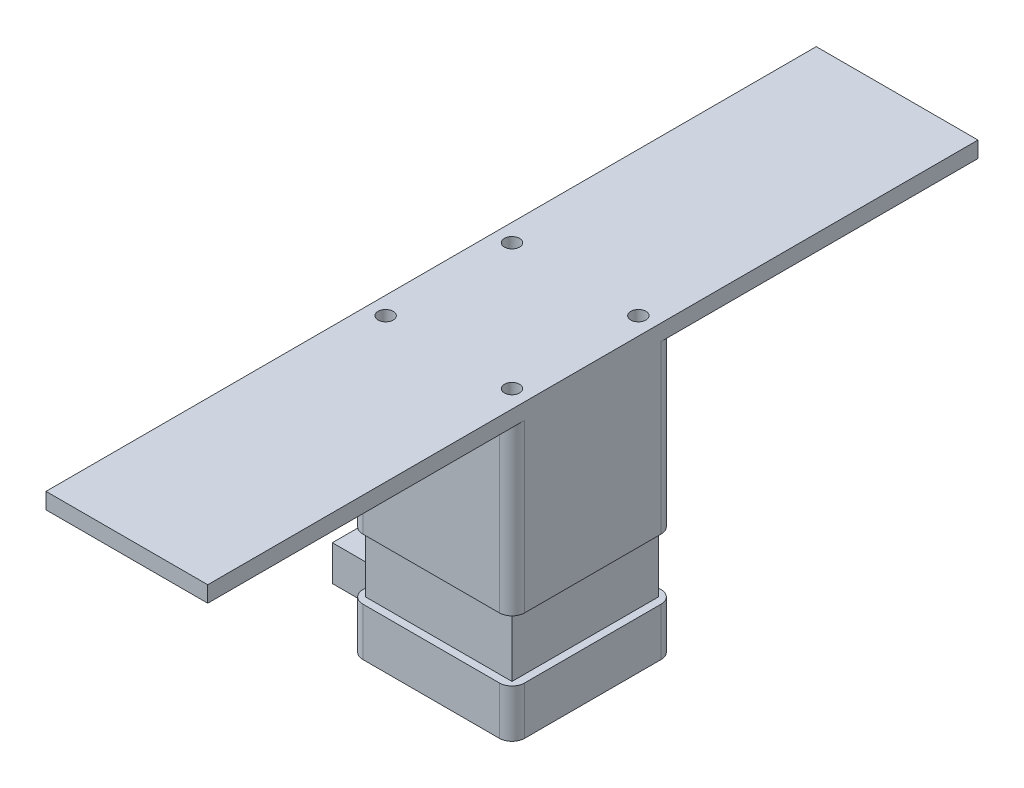
ISO-10303-21;
HEADER;
FILE_DESCRIPTION(('STEP AP214'),'2;1');
FILE_NAME('part.step','',(''),(''),'','','');
FILE_SCHEMA(('AUTOMOTIVE_DESIGN { 1 0 10303 214 1 1 1 1 }'));
ENDSEC;
DATA;
#1=APPLICATION_CONTEXT('core data for automotive mechanical design processes');
#2=APPLICATION_PROTOCOL_DEFINITION('international standard','automotive_design',2000,#1);
#3=PRODUCT_CONTEXT('',#1,'mechanical');
#4=PRODUCT('Part','Part','',(#3));
#5=PRODUCT_RELATED_PRODUCT_CATEGORY('part','',(#4));
#6=PRODUCT_DEFINITION_FORMATION('','',#4);
#7=PRODUCT_DEFINITION_CONTEXT('part definition',#1,'design');
#8=PRODUCT_DEFINITION('design','',#6,#7);
#9=PRODUCT_DEFINITION_SHAPE('','',#8);
#10=(LENGTH_UNIT() NAMED_UNIT(*) SI_UNIT(.MILLI.,.METRE.));
#11=(NAMED_UNIT(*) PLANE_ANGLE_UNIT() SI_UNIT($,.RADIAN.));
#12=(NAMED_UNIT(*) SI_UNIT($,.STERADIAN.) SOLID_ANGLE_UNIT());
#13=UNCERTAINTY_MEASURE_WITH_UNIT(LENGTH_MEASURE(1.E-05),#10,'distance_accuracy_value','');
#14=(GEOMETRIC_REPRESENTATION_CONTEXT(3) GLOBAL_UNCERTAINTY_ASSIGNED_CONTEXT((#13)) GLOBAL_UNIT_ASSIGNED_CONTEXT((#10,
#11,#12)) REPRESENTATION_CONTEXT('',''));
#15=CARTESIAN_POINT('',(0.,0.,0.));
#16=DIRECTION('',(0.,0.,1.));
#17=DIRECTION('',(1.,0.,0.));
#18=AXIS2_PLACEMENT_3D('',#15,#16,#17);
#19=CARTESIAN_POINT('',(0.,19.,5.00000000000004));
#20=DIRECTION('',(1.,0.,0.));
#21=DIRECTION('',(0.,0.,-1.));
#22=AXIS2_PLACEMENT_3D('',#19,#20,#21);
#23=PLANE('',#22);
#24=DIRECTION('',(0.,0.,1.));
#25=VECTOR('',#24,1.);
#26=CARTESIAN_POINT('',(0.,0.,5.00000000000004));
#27=LINE('',#26,#25);
#28=CARTESIAN_POINT('',(0.,0.,5.00000000000004));
#29=VERTEX_POINT('',#28);
#30=CARTESIAN_POINT('',(0.,0.,59.));
#31=VERTEX_POINT('',#30);
#32=EDGE_CURVE('E386',#29,#31,#27,.T.);
#33=ORIENTED_EDGE('',*,*,#32,.T.);
#34=DIRECTION('',(0.,-1.,0.));
#35=VECTOR('',#34,1.);
#36=CARTESIAN_POINT('',(0.,19.,59.));
#37=LINE('',#36,#35);
#38=CARTESIAN_POINT('',(0.,19.,59.));
#39=VERTEX_POINT('',#38);
#40=EDGE_CURVE('E41',#39,#31,#37,.T.);
#41=ORIENTED_EDGE('',*,*,#40,.F.);
#42=DIRECTION('',(0.,0.,1.));
#43=VECTOR('',#42,1.);
#44=CARTESIAN_POINT('',(0.,19.,5.00000000000004));
#45=LINE('',#44,#43);
#46=CARTESIAN_POINT('',(0.,19.,5.00000000000004));
#47=VERTEX_POINT('',#46);
#48=EDGE_CURVE('E368',#47,#39,#45,.T.);
#49=ORIENTED_EDGE('',*,*,#48,.F.);
#50=DIRECTION('',(0.,-1.,0.));
#51=VECTOR('',#50,1.);
#52=CARTESIAN_POINT('',(0.,19.,5.00000000000004));
#53=LINE('',#52,#51);
#54=EDGE_CURVE('E11',#47,#29,#53,.T.);
#55=ORIENTED_EDGE('',*,*,#54,.T.);
#56=EDGE_LOOP('',(#33,#41,#49,#55));
#57=FACE_BOUND('',#56,.T.);
#58=DIRECTION('',(0.,-1.,0.));
#59=VECTOR('',#58,1.);
#60=CARTESIAN_POINT('',(0.,16.,18.));
#61=LINE('',#60,#59);
#62=CARTESIAN_POINT('',(0.,16.,18.));
#63=VERTEX_POINT('',#62);
#64=CARTESIAN_POINT('',(0.,2.,18.));
#65=VERTEX_POINT('',#64);
#66=EDGE_CURVE('E241',#63,#65,#61,.T.);
#67=ORIENTED_EDGE('',*,*,#66,.F.);
#68=DIRECTION('',(0.,0.,-1.));
#69=VECTOR('',#68,1.);
#70=CARTESIAN_POINT('',(0.,16.,18.));
#71=LINE('',#70,#69);
#72=CARTESIAN_POINT('',(0.,16.,46.));
#73=VERTEX_POINT('',#72);
#74=EDGE_CURVE('E253',#73,#63,#71,.T.);
#75=ORIENTED_EDGE('',*,*,#74,.F.);
#76=DIRECTION('',(0.,1.,0.));
#77=VECTOR('',#76,1.);
#78=CARTESIAN_POINT('',(0.,16.,46.));
#79=LINE('',#78,#77);
#80=CARTESIAN_POINT('',(0.,2.,46.));
#81=VERTEX_POINT('',#80);
#82=EDGE_CURVE('E53',#81,#73,#79,.T.);
#83=ORIENTED_EDGE('',*,*,#82,.F.);
#84=DIRECTION('',(0.,0.,1.));
#85=VECTOR('',#84,1.);
#86=CARTESIAN_POINT('',(0.,2.,18.));
#87=LINE('',#86,#85);
#88=EDGE_CURVE('E48',#65,#81,#87,.T.);
#89=ORIENTED_EDGE('',*,*,#88,.F.);
#90=EDGE_LOOP('',(#67,#75,#83,#89));
#91=FACE_BOUND('',#90,.T.);
#92=ADVANCED_FACE('F33',(#57,#91),#23,.F.);
#93=CARTESIAN_POINT('',(5.,19.,5.));
#94=DIRECTION('',(0.,-1.,0.));
#95=DIRECTION('',(0.,0.,-1.));
#96=AXIS2_PLACEMENT_3D('',#93,#94,#95);
#97=CYLINDRICAL_SURFACE('',#96,5.);
#98=CARTESIAN_POINT('',(5.,0.,5.));
#99=DIRECTION('',(0.,1.,0.));
#100=DIRECTION('',(0.,0.,1.));
#101=AXIS2_PLACEMENT_3D('',#98,#99,#100);
#102=CIRCLE('',#101,5.);
#103=CARTESIAN_POINT('',(5.00000000000004,0.,0.));
#104=VERTEX_POINT('',#103);
#105=EDGE_CURVE('E364',#104,#29,#102,.T.);
#106=ORIENTED_EDGE('',*,*,#105,.T.);
#107=ORIENTED_EDGE('',*,*,#54,.F.);
#108=CARTESIAN_POINT('',(5.,19.,5.));
#109=DIRECTION('',(0.,1.,0.));
#110=DIRECTION('',(0.,0.,1.));
#111=AXIS2_PLACEMENT_3D('',#108,#109,#110);
#112=CIRCLE('',#111,5.);
#113=CARTESIAN_POINT('',(5.00000000000004,19.,0.));
#114=VERTEX_POINT('',#113);
#115=EDGE_CURVE('E365',#114,#47,#112,.T.);
#116=ORIENTED_EDGE('',*,*,#115,.F.);
#117=DIRECTION('',(0.,-1.,0.));
#118=VECTOR('',#117,1.);
#119=CARTESIAN_POINT('',(5.00000000000004,19.,0.));
#120=LINE('',#119,#118);
#121=EDGE_CURVE('E383',#114,#104,#120,.T.);
#122=ORIENTED_EDGE('',*,*,#121,.T.);
#123=EDGE_LOOP('',(#106,#107,#116,#122));
#124=FACE_BOUND('',#123,.T.);
#125=ADVANCED_FACE('F35',(#124),#97,.T.);
#126=CARTESIAN_POINT('',(5.00000000000001,19.,59.));
#127=DIRECTION('',(0.,-1.,0.));
#128=DIRECTION('',(0.,0.,-1.));
#129=AXIS2_PLACEMENT_3D('',#126,#127,#128);
#130=CYLINDRICAL_SURFACE('',#129,5.);
#131=CARTESIAN_POINT('',(5.00000000000001,0.,59.));
#132=DIRECTION('',(0.,1.,0.));
#133=DIRECTION('',(0.,0.,1.));
#134=AXIS2_PLACEMENT_3D('',#131,#132,#133);
#135=CIRCLE('',#134,5.);
#136=CARTESIAN_POINT('',(5.00000000000005,0.,64.));
#137=VERTEX_POINT('',#136);
#138=EDGE_CURVE('E388',#31,#137,#135,.T.);
#139=ORIENTED_EDGE('',*,*,#138,.T.);
#140=DIRECTION('',(0.,-1.,0.));
#141=VECTOR('',#140,1.);
#142=CARTESIAN_POINT('',(5.00000000000005,19.,64.));
#143=LINE('',#142,#141);
#144=CARTESIAN_POINT('',(5.00000000000005,19.,64.));
#145=VERTEX_POINT('',#144);
#146=EDGE_CURVE('E413',#145,#137,#143,.T.);
#147=ORIENTED_EDGE('',*,*,#146,.F.);
#148=CARTESIAN_POINT('',(5.00000000000001,19.,59.));
#149=DIRECTION('',(0.,1.,0.));
#150=DIRECTION('',(0.,0.,1.));
#151=AXIS2_PLACEMENT_3D('',#148,#149,#150);
#152=CIRCLE('',#151,5.);
#153=EDGE_CURVE('E371',#39,#145,#152,.T.);
#154=ORIENTED_EDGE('',*,*,#153,.F.);
#155=ORIENTED_EDGE('',*,*,#40,.T.);
#156=EDGE_LOOP('',(#139,#147,#154,#155));
#157=FACE_BOUND('',#156,.T.);
#158=ADVANCED_FACE('F420',(#157),#130,.T.);
#159=CARTESIAN_POINT('',(5.00000000000005,19.,64.));
#160=DIRECTION('',(0.,0.,-1.));
#161=DIRECTION('',(-1.,0.,0.));
#162=AXIS2_PLACEMENT_3D('',#159,#160,#161);
#163=PLANE('',#162);
#164=DIRECTION('',(1.,0.,0.));
#165=VECTOR('',#164,1.);
#166=CARTESIAN_POINT('',(5.00000000000005,0.,64.));
#167=LINE('',#166,#165);
#168=CARTESIAN_POINT('',(59.,0.,64.));
#169=VERTEX_POINT('',#168);
#170=EDGE_CURVE('E390',#137,#169,#167,.T.);
#171=ORIENTED_EDGE('',*,*,#170,.T.);
#172=DIRECTION('',(0.,-1.,0.));
#173=VECTOR('',#172,1.);
#174=CARTESIAN_POINT('',(59.,19.,64.));
#175=LINE('',#174,#173);
#176=CARTESIAN_POINT('',(59.,19.,64.));
#177=VERTEX_POINT('',#176);
#178=EDGE_CURVE('E410',#177,#169,#175,.T.);
#179=ORIENTED_EDGE('',*,*,#178,.F.);
#180=DIRECTION('',(1.,0.,0.));
#181=VECTOR('',#180,1.);
#182=CARTESIAN_POINT('',(5.00000000000005,19.,64.));
#183=LINE('',#182,#181);
#184=EDGE_CURVE('E373',#145,#177,#183,.T.);
#185=ORIENTED_EDGE('',*,*,#184,.F.);
#186=ORIENTED_EDGE('',*,*,#146,.T.);
#187=EDGE_LOOP('',(#171,#179,#185,#186));
#188=FACE_BOUND('',#187,.T.);
#189=ADVANCED_FACE('F431',(#188),#163,.F.);
#190=CARTESIAN_POINT('',(59.,19.,59.));
#191=DIRECTION('',(0.,-1.,0.));
#192=DIRECTION('',(0.,0.,-1.));
#193=AXIS2_PLACEMENT_3D('',#190,#191,#192);
#194=CYLINDRICAL_SURFACE('',#193,5.);
#195=CARTESIAN_POINT('',(59.,0.,59.));
#196=DIRECTION('',(0.,1.,0.));
#197=DIRECTION('',(0.,0.,-1.));
#198=AXIS2_PLACEMENT_3D('',#195,#196,#197);
#199=CIRCLE('',#198,5.);
#200=CARTESIAN_POINT('',(64.,0.,59.));
#201=VERTEX_POINT('',#200);
#202=EDGE_CURVE('E392',#169,#201,#199,.T.);
#203=ORIENTED_EDGE('',*,*,#202,.T.);
#204=DIRECTION('',(0.,-1.,0.));
#205=VECTOR('',#204,1.);
#206=CARTESIAN_POINT('',(64.,19.,59.));
#207=LINE('',#206,#205);
#208=CARTESIAN_POINT('',(64.,19.,59.));
#209=VERTEX_POINT('',#208);
#210=EDGE_CURVE('E407',#209,#201,#207,.T.);
#211=ORIENTED_EDGE('',*,*,#210,.F.);
#212=CARTESIAN_POINT('',(59.,19.,59.));
#213=DIRECTION('',(0.,1.,0.));
#214=DIRECTION('',(0.,0.,-1.));
#215=AXIS2_PLACEMENT_3D('',#212,#213,#214);
#216=CIRCLE('',#215,5.);
#217=EDGE_CURVE('E375',#177,#209,#216,.T.);
#218=ORIENTED_EDGE('',*,*,#217,.F.);
#219=ORIENTED_EDGE('',*,*,#178,.T.);
#220=EDGE_LOOP('',(#203,#211,#218,#219));
#221=FACE_BOUND('',#220,.T.);
#222=ADVANCED_FACE('F435',(#221),#194,.T.);
#223=CARTESIAN_POINT('',(64.,19.,5.00000000000003));
#224=DIRECTION('',(-1.,0.,0.));
#225=DIRECTION('',(0.,0.,1.));
#226=AXIS2_PLACEMENT_3D('',#223,#224,#225);
#227=PLANE('',#226);
#228=DIRECTION('',(0.,0.,-1.));
#229=VECTOR('',#228,1.);
#230=CARTESIAN_POINT('',(64.,0.,5.00000000000003));
#231=LINE('',#230,#229);
#232=CARTESIAN_POINT('',(64.,0.,5.00000000000004));
#233=VERTEX_POINT('',#232);
#234=EDGE_CURVE('E394',#201,#233,#231,.T.);
#235=ORIENTED_EDGE('',*,*,#234,.T.);
#236=DIRECTION('',(0.,-1.,0.));
#237=VECTOR('',#236,1.);
#238=CARTESIAN_POINT('',(64.,19.,5.00000000000004));
#239=LINE('',#238,#237);
#240=CARTESIAN_POINT('',(64.,19.,5.00000000000004));
#241=VERTEX_POINT('',#240);
#242=EDGE_CURVE('E404',#241,#233,#239,.T.);
#243=ORIENTED_EDGE('',*,*,#242,.F.);
#244=DIRECTION('',(0.,0.,-1.));
#245=VECTOR('',#244,1.);
#246=CARTESIAN_POINT('',(64.,19.,5.00000000000003));
#247=LINE('',#246,#245);
#248=EDGE_CURVE('E377',#209,#241,#247,.T.);
#249=ORIENTED_EDGE('',*,*,#248,.F.);
#250=ORIENTED_EDGE('',*,*,#210,.T.);
#251=EDGE_LOOP('',(#235,#243,#249,#250));
#252=FACE_BOUND('',#251,.T.);
#253=ADVANCED_FACE('F455',(#252),#227,.F.);
#254=CARTESIAN_POINT('',(59.,19.,5.));
#255=DIRECTION('',(0.,-1.,0.));
#256=DIRECTION('',(0.,0.,-1.));
#257=AXIS2_PLACEMENT_3D('',#254,#255,#256);
#258=CYLINDRICAL_SURFACE('',#257,5.);
#259=CARTESIAN_POINT('',(59.,0.,5.));
#260=DIRECTION('',(0.,1.,0.));
#261=DIRECTION('',(0.,0.,-1.));
#262=AXIS2_PLACEMENT_3D('',#259,#260,#261);
#263=CIRCLE('',#262,5.);
#264=CARTESIAN_POINT('',(59.,0.,0.));
#265=VERTEX_POINT('',#264);
#266=EDGE_CURVE('E396',#233,#265,#263,.T.);
#267=ORIENTED_EDGE('',*,*,#266,.T.);
#268=DIRECTION('',(0.,-1.,0.));
#269=VECTOR('',#268,1.);
#270=CARTESIAN_POINT('',(59.,19.,0.));
#271=LINE('',#270,#269);
#272=CARTESIAN_POINT('',(59.,19.,0.));
#273=VERTEX_POINT('',#272);
#274=EDGE_CURVE('E401',#273,#265,#271,.T.);
#275=ORIENTED_EDGE('',*,*,#274,.F.);
#276=CARTESIAN_POINT('',(59.,19.,5.));
#277=DIRECTION('',(0.,1.,0.));
#278=DIRECTION('',(0.,0.,-1.));
#279=AXIS2_PLACEMENT_3D('',#276,#277,#278);
#280=CIRCLE('',#279,5.);
#281=EDGE_CURVE('E379',#241,#273,#280,.T.);
#282=ORIENTED_EDGE('',*,*,#281,.F.);
#283=ORIENTED_EDGE('',*,*,#242,.T.);
#284=EDGE_LOOP('',(#267,#275,#282,#283));
#285=FACE_BOUND('',#284,.T.);
#286=ADVANCED_FACE('F453',(#285),#258,.T.);
#287=CARTESIAN_POINT('',(5.00000000000004,19.,0.));
#288=DIRECTION('',(0.,0.,1.));
#289=DIRECTION('',(1.,0.,0.));
#290=AXIS2_PLACEMENT_3D('',#287,#288,#289);
#291=PLANE('',#290);
#292=DIRECTION('',(-1.,0.,0.));
#293=VECTOR('',#292,1.);
#294=CARTESIAN_POINT('',(5.00000000000004,0.,0.));
#295=LINE('',#294,#293);
#296=EDGE_CURVE('E369',#265,#104,#295,.T.);
#297=ORIENTED_EDGE('',*,*,#296,.T.);
#298=ORIENTED_EDGE('',*,*,#121,.F.);
#299=DIRECTION('',(-1.,0.,0.));
#300=VECTOR('',#299,1.);
#301=CARTESIAN_POINT('',(5.00000000000004,19.,0.));
#302=LINE('',#301,#300);
#303=EDGE_CURVE('E381',#273,#114,#302,.T.);
#304=ORIENTED_EDGE('',*,*,#303,.F.);
#305=ORIENTED_EDGE('',*,*,#274,.T.);
#306=EDGE_LOOP('',(#297,#298,#304,#305));
#307=FACE_BOUND('',#306,.T.);
#308=ADVANCED_FACE('F448',(#307),#291,.F.);
#309=CARTESIAN_POINT('',(5.,19.,5.));
#310=DIRECTION('',(0.,1.,0.));
#311=DIRECTION('',(0.,0.,1.));
#312=AXIS2_PLACEMENT_3D('',#309,#310,#311);
#313=PLANE('',#312);
#314=DIRECTION('',(0.,0.,1.));
#315=VECTOR('',#314,1.);
#316=CARTESIAN_POINT('',(3.,19.,3.));
#317=LINE('',#316,#315);
#318=CARTESIAN_POINT('',(3.,19.,3.));
#319=VERTEX_POINT('',#318);
#320=CARTESIAN_POINT('',(3.00000000000001,19.,61.));
#321=VERTEX_POINT('',#320);
#322=EDGE_CURVE('E328',#319,#321,#317,.T.);
#323=ORIENTED_EDGE('',*,*,#322,.F.);
#324=DIRECTION('',(-1.,0.,0.));
#325=VECTOR('',#324,1.);
#326=CARTESIAN_POINT('',(3.,19.,3.));
#327=LINE('',#326,#325);
#328=CARTESIAN_POINT('',(61.,19.,3.));
#329=VERTEX_POINT('',#328);
#330=EDGE_CURVE('E333',#329,#319,#327,.T.);
#331=ORIENTED_EDGE('',*,*,#330,.F.);
#332=DIRECTION('',(0.,0.,-1.));
#333=VECTOR('',#332,1.);
#334=CARTESIAN_POINT('',(61.,19.,3.));
#335=LINE('',#334,#333);
#336=CARTESIAN_POINT('',(61.,19.,61.));
#337=VERTEX_POINT('',#336);
#338=EDGE_CURVE('E348',#337,#329,#335,.T.);
#339=ORIENTED_EDGE('',*,*,#338,.F.);
#340=DIRECTION('',(1.,0.,0.));
#341=VECTOR('',#340,1.);
#342=CARTESIAN_POINT('',(3.00000000000001,19.,61.));
#343=LINE('',#342,#341);
#344=EDGE_CURVE('E345',#321,#337,#343,.T.);
#345=ORIENTED_EDGE('',*,*,#344,.F.);
#346=EDGE_LOOP('',(#323,#331,#339,#345));
#347=FACE_BOUND('',#346,.T.);
#348=ORIENTED_EDGE('',*,*,#115,.T.);
#349=ORIENTED_EDGE('',*,*,#48,.T.);
#350=ORIENTED_EDGE('',*,*,#153,.T.);
#351=ORIENTED_EDGE('',*,*,#184,.T.);
#352=ORIENTED_EDGE('',*,*,#217,.T.);
#353=ORIENTED_EDGE('',*,*,#248,.T.);
#354=ORIENTED_EDGE('',*,*,#281,.T.);
#355=ORIENTED_EDGE('',*,*,#303,.T.);
#356=EDGE_LOOP('',(#348,#349,#350,#351,#352,#353,#354,#355));
#357=FACE_BOUND('',#356,.T.);
#358=ADVANCED_FACE('F439',(#347,#357),#313,.T.);
#359=CARTESIAN_POINT('',(5.,0.,5.));
#360=DIRECTION('',(0.,1.,0.));
#361=DIRECTION('',(0.,0.,1.));
#362=AXIS2_PLACEMENT_3D('',#359,#360,#361);
#363=PLANE('',#362);
#364=ORIENTED_EDGE('',*,*,#105,.F.);
#365=ORIENTED_EDGE('',*,*,#296,.F.);
#366=ORIENTED_EDGE('',*,*,#266,.F.);
#367=ORIENTED_EDGE('',*,*,#234,.F.);
#368=ORIENTED_EDGE('',*,*,#202,.F.);
#369=ORIENTED_EDGE('',*,*,#170,.F.);
#370=ORIENTED_EDGE('',*,*,#138,.F.);
#371=ORIENTED_EDGE('',*,*,#32,.F.);
#372=EDGE_LOOP('',(#364,#365,#366,#367,#368,#369,#370,#371));
#373=FACE_BOUND('',#372,.T.);
#374=ADVANCED_FACE('F426',(#373),#363,.F.);
#375=CARTESIAN_POINT('',(3.,43.,3.));
#376=DIRECTION('',(1.,0.,0.));
#377=DIRECTION('',(0.,0.,-1.));
#378=AXIS2_PLACEMENT_3D('',#375,#376,#377);
#379=PLANE('',#378);
#380=ORIENTED_EDGE('',*,*,#322,.T.);
#381=DIRECTION('',(0.,-1.,0.));
#382=VECTOR('',#381,1.);
#383=CARTESIAN_POINT('',(3.00000000000001,43.,61.));
#384=LINE('',#383,#382);
#385=CARTESIAN_POINT('',(3.00000000000001,43.,61.));
#386=VERTEX_POINT('',#385);
#387=EDGE_CURVE('E361',#386,#321,#384,.T.);
#388=ORIENTED_EDGE('',*,*,#387,.F.);
#389=DIRECTION('',(0.,0.,1.));
#390=VECTOR('',#389,1.);
#391=CARTESIAN_POINT('',(3.,43.,3.));
#392=LINE('',#391,#390);
#393=CARTESIAN_POINT('',(3.,43.,3.));
#394=VERTEX_POINT('',#393);
#395=EDGE_CURVE('E329',#394,#386,#392,.T.);
#396=ORIENTED_EDGE('',*,*,#395,.F.);
#397=DIRECTION('',(0.,-1.,0.));
#398=VECTOR('',#397,1.);
#399=CARTESIAN_POINT('',(3.,43.,3.));
#400=LINE('',#399,#398);
#401=EDGE_CURVE('E342',#394,#319,#400,.T.);
#402=ORIENTED_EDGE('',*,*,#401,.T.);
#403=EDGE_LOOP('',(#380,#388,#396,#402));
#404=FACE_BOUND('',#403,.T.);
#405=ADVANCED_FACE('F509',(#404),#379,.F.);
#406=CARTESIAN_POINT('',(3.00000000000001,43.,61.));
#407=DIRECTION('',(0.,0.,-1.));
#408=DIRECTION('',(-1.,0.,0.));
#409=AXIS2_PLACEMENT_3D('',#406,#407,#408);
#410=PLANE('',#409);
#411=ORIENTED_EDGE('',*,*,#344,.T.);
#412=DIRECTION('',(0.,-1.,0.));
#413=VECTOR('',#412,1.);
#414=CARTESIAN_POINT('',(61.,43.,61.));
#415=LINE('',#414,#413);
#416=CARTESIAN_POINT('',(61.,43.,61.));
#417=VERTEX_POINT('',#416);
#418=EDGE_CURVE('E358',#417,#337,#415,.T.);
#419=ORIENTED_EDGE('',*,*,#418,.F.);
#420=DIRECTION('',(1.,0.,0.));
#421=VECTOR('',#420,1.);
#422=CARTESIAN_POINT('',(3.00000000000001,43.,61.));
#423=LINE('',#422,#421);
#424=EDGE_CURVE('E332',#386,#417,#423,.T.);
#425=ORIENTED_EDGE('',*,*,#424,.F.);
#426=ORIENTED_EDGE('',*,*,#387,.T.);
#427=EDGE_LOOP('',(#411,#419,#425,#426));
#428=FACE_BOUND('',#427,.T.);
#429=ADVANCED_FACE('F525',(#428),#410,.F.);
#430=CARTESIAN_POINT('',(61.,43.,3.));
#431=DIRECTION('',(-1.,0.,0.));
#432=DIRECTION('',(0.,0.,1.));
#433=AXIS2_PLACEMENT_3D('',#430,#431,#432);
#434=PLANE('',#433);
#435=ORIENTED_EDGE('',*,*,#338,.T.);
#436=DIRECTION('',(0.,-1.,0.));
#437=VECTOR('',#436,1.);
#438=CARTESIAN_POINT('',(61.,43.,3.));
#439=LINE('',#438,#437);
#440=CARTESIAN_POINT('',(61.,43.,3.));
#441=VERTEX_POINT('',#440);
#442=EDGE_CURVE('E355',#441,#329,#439,.T.);
#443=ORIENTED_EDGE('',*,*,#442,.F.);
#444=DIRECTION('',(0.,0.,-1.));
#445=VECTOR('',#444,1.);
#446=CARTESIAN_POINT('',(61.,43.,3.));
#447=LINE('',#446,#445);
#448=EDGE_CURVE('E336',#417,#441,#447,.T.);
#449=ORIENTED_EDGE('',*,*,#448,.F.);
#450=ORIENTED_EDGE('',*,*,#418,.T.);
#451=EDGE_LOOP('',(#435,#443,#449,#450));
#452=FACE_BOUND('',#451,.T.);
#453=ADVANCED_FACE('F535',(#452),#434,.F.);
#454=CARTESIAN_POINT('',(3.,43.,3.));
#455=DIRECTION('',(0.,0.,1.));
#456=DIRECTION('',(1.,0.,0.));
#457=AXIS2_PLACEMENT_3D('',#454,#455,#456);
#458=PLANE('',#457);
#459=ORIENTED_EDGE('',*,*,#330,.T.);
#460=ORIENTED_EDGE('',*,*,#401,.F.);
#461=DIRECTION('',(-1.,0.,0.));
#462=VECTOR('',#461,1.);
#463=CARTESIAN_POINT('',(3.,43.,3.));
#464=LINE('',#463,#462);
#465=EDGE_CURVE('E339',#441,#394,#464,.T.);
#466=ORIENTED_EDGE('',*,*,#465,.F.);
#467=ORIENTED_EDGE('',*,*,#442,.T.);
#468=EDGE_LOOP('',(#459,#460,#466,#467));
#469=FACE_BOUND('',#468,.T.);
#470=ADVANCED_FACE('F545',(#469),#458,.F.);
#471=CARTESIAN_POINT('',(5.,43.,5.));
#472=DIRECTION('',(0.,1.,0.));
#473=DIRECTION('',(0.,0.,1.));
#474=AXIS2_PLACEMENT_3D('',#471,#472,#473);
#475=PLANE('',#474);
#476=CARTESIAN_POINT('',(5.,43.,5.));
#477=DIRECTION('',(0.,1.,0.));
#478=DIRECTION('',(0.,0.,1.));
#479=AXIS2_PLACEMENT_3D('',#476,#477,#478);
#480=CIRCLE('',#479,5.);
#481=CARTESIAN_POINT('',(5.00000000000004,43.,0.));
#482=VERTEX_POINT('',#481);
#483=CARTESIAN_POINT('',(0.,43.,5.00000000000004));
#484=VERTEX_POINT('',#483);
#485=EDGE_CURVE('E274',#482,#484,#480,.T.);
#486=ORIENTED_EDGE('',*,*,#485,.F.);
#487=DIRECTION('',(1.,0.,0.));
#488=VECTOR('',#487,1.);
#489=CARTESIAN_POINT('',(5.00000000000004,43.,0.));
#490=LINE('',#489,#488);
#491=CARTESIAN_POINT('',(59.,43.,0.));
#492=VERTEX_POINT('',#491);
#493=EDGE_CURVE('E278',#482,#492,#490,.T.);
#494=ORIENTED_EDGE('',*,*,#493,.T.);
#495=CARTESIAN_POINT('',(59.,43.,5.));
#496=DIRECTION('',(0.,1.,0.));
#497=DIRECTION('',(0.,0.,1.));
#498=AXIS2_PLACEMENT_3D('',#495,#496,#497);
#499=CIRCLE('',#498,5.);
#500=CARTESIAN_POINT('',(64.,43.,5.00000000000004));
#501=VERTEX_POINT('',#500);
#502=EDGE_CURVE('E304',#501,#492,#499,.T.);
#503=ORIENTED_EDGE('',*,*,#502,.F.);
#504=DIRECTION('',(0.,0.,1.));
#505=VECTOR('',#504,1.);
#506=CARTESIAN_POINT('',(64.,43.,5.00000000000004));
#507=LINE('',#506,#505);
#508=CARTESIAN_POINT('',(64.,43.,58.9995418392291));
#509=VERTEX_POINT('',#508);
#510=EDGE_CURVE('E301',#501,#509,#507,.T.);
#511=ORIENTED_EDGE('',*,*,#510,.T.);
#512=CARTESIAN_POINT('',(59.,43.,58.9995418392291));
#513=DIRECTION('',(0.,1.,0.));
#514=DIRECTION('',(0.,0.,1.));
#515=AXIS2_PLACEMENT_3D('',#512,#513,#514);
#516=CIRCLE('',#515,5.);
#517=CARTESIAN_POINT('',(59.,43.,63.9995418392291));
#518=VERTEX_POINT('',#517);
#519=EDGE_CURVE('E298',#518,#509,#516,.T.);
#520=ORIENTED_EDGE('',*,*,#519,.F.);
#521=DIRECTION('',(1.,0.,0.));
#522=VECTOR('',#521,1.);
#523=CARTESIAN_POINT('',(5.00000000000004,43.,63.9995418392291));
#524=LINE('',#523,#522);
#525=CARTESIAN_POINT('',(5.,43.,63.9995418392291));
#526=VERTEX_POINT('',#525);
#527=EDGE_CURVE('E296',#526,#518,#524,.T.);
#528=ORIENTED_EDGE('',*,*,#527,.F.);
#529=CARTESIAN_POINT('',(5.,43.,58.9995418392291));
#530=DIRECTION('',(0.,1.,0.));
#531=DIRECTION('',(0.,0.,1.));
#532=AXIS2_PLACEMENT_3D('',#529,#530,#531);
#533=CIRCLE('',#532,5.);
#534=CARTESIAN_POINT('',(0.,43.,58.9995418392291));
#535=VERTEX_POINT('',#534);
#536=EDGE_CURVE('E294',#535,#526,#533,.T.);
#537=ORIENTED_EDGE('',*,*,#536,.F.);
#538=DIRECTION('',(0.,0.,1.));
#539=VECTOR('',#538,1.);
#540=CARTESIAN_POINT('',(0.,43.,5.00000000000004));
#541=LINE('',#540,#539);
#542=EDGE_CURVE('E292',#484,#535,#541,.T.);
#543=ORIENTED_EDGE('',*,*,#542,.F.);
#544=EDGE_LOOP('',(#486,#494,#503,#511,#520,#528,#537,#543));
#545=FACE_BOUND('',#544,.T.);
#546=ORIENTED_EDGE('',*,*,#465,.T.);
#547=ORIENTED_EDGE('',*,*,#395,.T.);
#548=ORIENTED_EDGE('',*,*,#424,.T.);
#549=ORIENTED_EDGE('',*,*,#448,.T.);
#550=EDGE_LOOP('',(#546,#547,#548,#549));
#551=FACE_BOUND('',#550,.T.);
#552=ADVANCED_FACE('F555',(#545,#551),#475,.F.);
#553=CARTESIAN_POINT('',(5.,109.,5.));
#554=DIRECTION('',(0.,-1.,0.));
#555=DIRECTION('',(0.,0.,-1.));
#556=AXIS2_PLACEMENT_3D('',#553,#554,#555);
#557=CYLINDRICAL_SURFACE('',#556,5.);
#558=ORIENTED_EDGE('',*,*,#485,.T.);
#559=DIRECTION('',(0.,-1.,0.));
#560=VECTOR('',#559,1.);
#561=CARTESIAN_POINT('',(0.,109.,5.00000000000004));
#562=LINE('',#561,#560);
#563=CARTESIAN_POINT('',(0.,109.,5.));
#564=VERTEX_POINT('',#563);
#565=EDGE_CURVE('E325',#564,#484,#562,.T.);
#566=ORIENTED_EDGE('',*,*,#565,.F.);
#567=CARTESIAN_POINT('',(5.,109.,5.));
#568=DIRECTION('',(0.,1.,0.));
#569=DIRECTION('',(0.,0.,1.));
#570=AXIS2_PLACEMENT_3D('',#567,#568,#569);
#571=CIRCLE('',#570,5.);
#572=CARTESIAN_POINT('',(5.00000000000004,109.,0.));
#573=VERTEX_POINT('',#572);
#574=EDGE_CURVE('E275',#573,#564,#571,.T.);
#575=ORIENTED_EDGE('',*,*,#574,.F.);
#576=DIRECTION('',(0.,-1.,0.));
#577=VECTOR('',#576,1.);
#578=CARTESIAN_POINT('',(5.00000000000004,109.,0.));
#579=LINE('',#578,#577);
#580=EDGE_CURVE('E289',#573,#482,#579,.T.);
#581=ORIENTED_EDGE('',*,*,#580,.T.);
#582=EDGE_LOOP('',(#558,#566,#575,#581));
#583=FACE_BOUND('',#582,.T.);
#584=ADVANCED_FACE('F564',(#583),#557,.T.);
#585=CARTESIAN_POINT('',(0.,109.,5.00000000000004));
#586=DIRECTION('',(1.,0.,0.));
#587=DIRECTION('',(0.,0.,-1.));
#588=AXIS2_PLACEMENT_3D('',#585,#586,#587);
#589=PLANE('',#588);
#590=ORIENTED_EDGE('',*,*,#542,.T.);
#591=DIRECTION('',(0.,-1.,0.));
#592=VECTOR('',#591,1.);
#593=CARTESIAN_POINT('',(0.,109.,58.9995418392291));
#594=LINE('',#593,#592);
#595=CARTESIAN_POINT('',(0.,109.,58.9995418392291));
#596=VERTEX_POINT('',#595);
#597=EDGE_CURVE('E322',#596,#535,#594,.T.);
#598=ORIENTED_EDGE('',*,*,#597,.F.);
#599=DIRECTION('',(0.,0.,1.));
#600=VECTOR('',#599,1.);
#601=CARTESIAN_POINT('',(0.,109.,-120.4));
#602=LINE('',#601,#600);
#603=CARTESIAN_POINT('',(0.,109.,184.4));
#604=VERTEX_POINT('',#603);
#605=EDGE_CURVE('E239',#596,#604,#602,.T.);
#606=ORIENTED_EDGE('',*,*,#605,.T.);
#607=DIRECTION('',(0.,-1.,0.));
#608=VECTOR('',#607,1.);
#609=CARTESIAN_POINT('',(0.,115.35,184.4));
#610=LINE('',#609,#608);
#611=CARTESIAN_POINT('',(0.,115.35,184.4));
#612=VERTEX_POINT('',#611);
#613=EDGE_CURVE('E220',#612,#604,#610,.T.);
#614=ORIENTED_EDGE('',*,*,#613,.F.);
#615=DIRECTION('',(0.,0.,1.));
#616=VECTOR('',#615,1.);
#617=CARTESIAN_POINT('',(0.,115.35,-120.4));
#618=LINE('',#617,#616);
#619=CARTESIAN_POINT('',(0.,115.35,-120.4));
#620=VERTEX_POINT('',#619);
#621=EDGE_CURVE('E226',#620,#612,#618,.T.);
#622=ORIENTED_EDGE('',*,*,#621,.F.);
#623=DIRECTION('',(0.,-1.,0.));
#624=VECTOR('',#623,1.);
#625=CARTESIAN_POINT('',(0.,115.35,-120.4));
#626=LINE('',#625,#624);
#627=CARTESIAN_POINT('',(0.,109.,-120.4));
#628=VERTEX_POINT('',#627);
#629=EDGE_CURVE('E849',#620,#628,#626,.T.);
#630=ORIENTED_EDGE('',*,*,#629,.T.);
#631=EDGE_CURVE('E850',#628,#564,#602,.T.);
#632=ORIENTED_EDGE('',*,*,#631,.T.);
#633=ORIENTED_EDGE('',*,*,#565,.T.);
#634=EDGE_LOOP('',(#590,#598,#606,#614,#622,#630,#632,#633));
#635=FACE_BOUND('',#634,.T.);
#636=ADVANCED_FACE('F237',(#635),#589,.F.);
#637=CARTESIAN_POINT('',(5.,109.,58.9995418392291));
#638=DIRECTION('',(0.,-1.,0.));
#639=DIRECTION('',(0.,0.,-1.));
#640=AXIS2_PLACEMENT_3D('',#637,#638,#639);
#641=CYLINDRICAL_SURFACE('',#640,5.);
#642=ORIENTED_EDGE('',*,*,#536,.T.);
#643=DIRECTION('',(0.,-1.,0.));
#644=VECTOR('',#643,1.);
#645=CARTESIAN_POINT('',(5.,109.,63.9995418392291));
#646=LINE('',#645,#644);
#647=CARTESIAN_POINT('',(5.,109.,63.9995418392291));
#648=VERTEX_POINT('',#647);
#649=EDGE_CURVE('E319',#648,#526,#646,.T.);
#650=ORIENTED_EDGE('',*,*,#649,.F.);
#651=CARTESIAN_POINT('',(5.,109.,58.9995418392291));
#652=DIRECTION('',(0.,1.,0.));
#653=DIRECTION('',(0.,0.,1.));
#654=AXIS2_PLACEMENT_3D('',#651,#652,#653);
#655=CIRCLE('',#654,5.);
#656=EDGE_CURVE('E277',#596,#648,#655,.T.);
#657=ORIENTED_EDGE('',*,*,#656,.F.);
#658=ORIENTED_EDGE('',*,*,#597,.T.);
#659=EDGE_LOOP('',(#642,#650,#657,#658));
#660=FACE_BOUND('',#659,.T.);
#661=ADVANCED_FACE('F644',(#660),#641,.T.);
#662=CARTESIAN_POINT('',(5.00000000000004,109.,63.9995418392291));
#663=DIRECTION('',(0.,0.,-1.));
#664=DIRECTION('',(-1.,0.,0.));
#665=AXIS2_PLACEMENT_3D('',#662,#663,#664);
#666=PLANE('',#665);
#667=ORIENTED_EDGE('',*,*,#527,.T.);
#668=DIRECTION('',(0.,-1.,0.));
#669=VECTOR('',#668,1.);
#670=CARTESIAN_POINT('',(59.,109.,63.9995418392291));
#671=LINE('',#670,#669);
#672=CARTESIAN_POINT('',(59.,109.,63.9995418392291));
#673=VERTEX_POINT('',#672);
#674=EDGE_CURVE('E316',#673,#518,#671,.T.);
#675=ORIENTED_EDGE('',*,*,#674,.F.);
#676=DIRECTION('',(1.,0.,0.));
#677=VECTOR('',#676,1.);
#678=CARTESIAN_POINT('',(5.00000000000004,109.,63.9995418392291));
#679=LINE('',#678,#677);
#680=EDGE_CURVE('E280',#648,#673,#679,.T.);
#681=ORIENTED_EDGE('',*,*,#680,.F.);
#682=ORIENTED_EDGE('',*,*,#649,.T.);
#683=EDGE_LOOP('',(#667,#675,#681,#682));
#684=FACE_BOUND('',#683,.T.);
#685=ADVANCED_FACE('F654',(#684),#666,.F.);
#686=CARTESIAN_POINT('',(59.,109.,58.9995418392291));
#687=DIRECTION('',(0.,-1.,0.));
#688=DIRECTION('',(0.,0.,-1.));
#689=AXIS2_PLACEMENT_3D('',#686,#687,#688);
#690=CYLINDRICAL_SURFACE('',#689,5.);
#691=ORIENTED_EDGE('',*,*,#519,.T.);
#692=DIRECTION('',(0.,-1.,0.));
#693=VECTOR('',#692,1.);
#694=CARTESIAN_POINT('',(64.,109.,58.9995418392291));
#695=LINE('',#694,#693);
#696=CARTESIAN_POINT('',(64.,109.,58.9995418392291));
#697=VERTEX_POINT('',#696);
#698=EDGE_CURVE('E314',#697,#509,#695,.T.);
#699=ORIENTED_EDGE('',*,*,#698,.F.);
#700=CARTESIAN_POINT('',(59.,109.,58.9995418392291));
#701=DIRECTION('',(0.,1.,0.));
#702=DIRECTION('',(0.,0.,1.));
#703=AXIS2_PLACEMENT_3D('',#700,#701,#702);
#704=CIRCLE('',#703,5.);
#705=EDGE_CURVE('E282',#673,#697,#704,.T.);
#706=ORIENTED_EDGE('',*,*,#705,.F.);
#707=ORIENTED_EDGE('',*,*,#674,.T.);
#708=EDGE_LOOP('',(#691,#699,#706,#707));
#709=FACE_BOUND('',#708,.T.);
#710=ADVANCED_FACE('F664',(#709),#690,.T.);
#711=CARTESIAN_POINT('',(64.,109.,5.00000000000004));
#712=DIRECTION('',(1.,0.,0.));
#713=DIRECTION('',(0.,0.,-1.));
#714=AXIS2_PLACEMENT_3D('',#711,#712,#713);
#715=PLANE('',#714);
#716=ORIENTED_EDGE('',*,*,#510,.F.);
#717=DIRECTION('',(0.,-1.,0.));
#718=VECTOR('',#717,1.);
#719=CARTESIAN_POINT('',(64.,109.,5.00000000000004));
#720=LINE('',#719,#718);
#721=CARTESIAN_POINT('',(64.,109.,5.));
#722=VERTEX_POINT('',#721);
#723=EDGE_CURVE('E312',#722,#501,#720,.T.);
#724=ORIENTED_EDGE('',*,*,#723,.F.);
#725=DIRECTION('',(0.,0.,-1.));
#726=VECTOR('',#725,1.);
#727=CARTESIAN_POINT('',(64.,109.,-120.4));
#728=LINE('',#727,#726);
#729=CARTESIAN_POINT('',(64.,109.,-120.4));
#730=VERTEX_POINT('',#729);
#731=EDGE_CURVE('E855',#722,#730,#728,.T.);
#732=ORIENTED_EDGE('',*,*,#731,.T.);
#733=DIRECTION('',(0.,-1.,0.));
#734=VECTOR('',#733,1.);
#735=CARTESIAN_POINT('',(64.,115.35,-120.4));
#736=LINE('',#735,#734);
#737=CARTESIAN_POINT('',(64.,115.35,-120.4));
#738=VERTEX_POINT('',#737);
#739=EDGE_CURVE('E245',#738,#730,#736,.T.);
#740=ORIENTED_EDGE('',*,*,#739,.F.);
#741=DIRECTION('',(0.,0.,-1.));
#742=VECTOR('',#741,1.);
#743=CARTESIAN_POINT('',(64.,115.35,-120.4));
#744=LINE('',#743,#742);
#745=CARTESIAN_POINT('',(64.,115.35,184.4));
#746=VERTEX_POINT('',#745);
#747=EDGE_CURVE('E225',#746,#738,#744,.T.);
#748=ORIENTED_EDGE('',*,*,#747,.F.);
#749=DIRECTION('',(0.,-1.,0.));
#750=VECTOR('',#749,1.);
#751=CARTESIAN_POINT('',(64.,115.35,184.4));
#752=LINE('',#751,#750);
#753=CARTESIAN_POINT('',(64.,109.,184.4));
#754=VERTEX_POINT('',#753);
#755=EDGE_CURVE('E222',#746,#754,#752,.T.);
#756=ORIENTED_EDGE('',*,*,#755,.T.);
#757=EDGE_CURVE('E856',#754,#697,#728,.T.);
#758=ORIENTED_EDGE('',*,*,#757,.T.);
#759=ORIENTED_EDGE('',*,*,#698,.T.);
#760=EDGE_LOOP('',(#716,#724,#732,#740,#748,#756,#758,#759));
#761=FACE_BOUND('',#760,.T.);
#762=ADVANCED_FACE('F674',(#761),#715,.T.);
#763=CARTESIAN_POINT('',(59.,109.,5.));
#764=DIRECTION('',(0.,-1.,0.));
#765=DIRECTION('',(0.,0.,-1.));
#766=AXIS2_PLACEMENT_3D('',#763,#764,#765);
#767=CYLINDRICAL_SURFACE('',#766,5.);
#768=ORIENTED_EDGE('',*,*,#502,.T.);
#769=DIRECTION('',(0.,-1.,0.));
#770=VECTOR('',#769,1.);
#771=CARTESIAN_POINT('',(59.,109.,0.));
#772=LINE('',#771,#770);
#773=CARTESIAN_POINT('',(59.,109.,0.));
#774=VERTEX_POINT('',#773);
#775=EDGE_CURVE('E310',#774,#492,#772,.T.);
#776=ORIENTED_EDGE('',*,*,#775,.F.);
#777=CARTESIAN_POINT('',(59.,109.,5.));
#778=DIRECTION('',(0.,1.,0.));
#779=DIRECTION('',(0.,0.,1.));
#780=AXIS2_PLACEMENT_3D('',#777,#778,#779);
#781=CIRCLE('',#780,5.);
#782=EDGE_CURVE('E284',#722,#774,#781,.T.);
#783=ORIENTED_EDGE('',*,*,#782,.F.);
#784=ORIENTED_EDGE('',*,*,#723,.T.);
#785=EDGE_LOOP('',(#768,#776,#783,#784));
#786=FACE_BOUND('',#785,.T.);
#787=ADVANCED_FACE('F684',(#786),#767,.T.);
#788=CARTESIAN_POINT('',(5.00000000000004,109.,0.));
#789=DIRECTION('',(0.,0.,-1.));
#790=DIRECTION('',(-1.,0.,0.));
#791=AXIS2_PLACEMENT_3D('',#788,#789,#790);
#792=PLANE('',#791);
#793=ORIENTED_EDGE('',*,*,#493,.F.);
#794=ORIENTED_EDGE('',*,*,#580,.F.);
#795=DIRECTION('',(1.,0.,0.));
#796=VECTOR('',#795,1.);
#797=CARTESIAN_POINT('',(5.00000000000004,109.,0.));
#798=LINE('',#797,#796);
#799=EDGE_CURVE('E286',#573,#774,#798,.T.);
#800=ORIENTED_EDGE('',*,*,#799,.T.);
#801=ORIENTED_EDGE('',*,*,#775,.T.);
#802=EDGE_LOOP('',(#793,#794,#800,#801));
#803=FACE_BOUND('',#802,.T.);
#804=ADVANCED_FACE('F584',(#803),#792,.T.);
#805=CARTESIAN_POINT('',(-25.1,16.,18.));
#806=DIRECTION('',(0.,0.,1.));
#807=DIRECTION('',(1.,0.,0.));
#808=AXIS2_PLACEMENT_3D('',#805,#806,#807);
#809=PLANE('',#808);
#810=ORIENTED_EDGE('',*,*,#66,.T.);
#811=DIRECTION('',(1.,0.,0.));
#812=VECTOR('',#811,1.);
#813=CARTESIAN_POINT('',(-25.1,2.,18.));
#814=LINE('',#813,#812);
#815=CARTESIAN_POINT('',(-25.1,2.,18.));
#816=VERTEX_POINT('',#815);
#817=EDGE_CURVE('E272',#816,#65,#814,.T.);
#818=ORIENTED_EDGE('',*,*,#817,.F.);
#819=DIRECTION('',(0.,-1.,0.));
#820=VECTOR('',#819,1.);
#821=CARTESIAN_POINT('',(-25.1,16.,18.));
#822=LINE('',#821,#820);
#823=CARTESIAN_POINT('',(-25.1,16.,18.));
#824=VERTEX_POINT('',#823);
#825=EDGE_CURVE('E249',#824,#816,#822,.T.);
#826=ORIENTED_EDGE('',*,*,#825,.F.);
#827=DIRECTION('',(1.,0.,0.));
#828=VECTOR('',#827,1.);
#829=CARTESIAN_POINT('',(-25.1,16.,18.));
#830=LINE('',#829,#828);
#831=EDGE_CURVE('E258',#824,#63,#830,.T.);
#832=ORIENTED_EDGE('',*,*,#831,.T.);
#833=EDGE_LOOP('',(#810,#818,#826,#832));
#834=FACE_BOUND('',#833,.T.);
#835=ADVANCED_FACE('F579',(#834),#809,.F.);
#836=CARTESIAN_POINT('',(-25.1,2.,18.));
#837=DIRECTION('',(0.,1.,0.));
#838=DIRECTION('',(0.,0.,1.));
#839=AXIS2_PLACEMENT_3D('',#836,#837,#838);
#840=PLANE('',#839);
#841=ORIENTED_EDGE('',*,*,#88,.T.);
#842=DIRECTION('',(1.,0.,0.));
#843=VECTOR('',#842,1.);
#844=CARTESIAN_POINT('',(-25.1,2.,46.));
#845=LINE('',#844,#843);
#846=CARTESIAN_POINT('',(-25.1,2.,46.));
#847=VERTEX_POINT('',#846);
#848=EDGE_CURVE('E269',#847,#81,#845,.T.);
#849=ORIENTED_EDGE('',*,*,#848,.F.);
#850=DIRECTION('',(0.,0.,1.));
#851=VECTOR('',#850,1.);
#852=CARTESIAN_POINT('',(-25.1,2.,18.));
#853=LINE('',#852,#851);
#854=EDGE_CURVE('E252',#816,#847,#853,.T.);
#855=ORIENTED_EDGE('',*,*,#854,.F.);
#856=ORIENTED_EDGE('',*,*,#817,.T.);
#857=EDGE_LOOP('',(#841,#849,#855,#856));
#858=FACE_BOUND('',#857,.T.);
#859=ADVANCED_FACE('F583',(#858),#840,.F.);
#860=CARTESIAN_POINT('',(-25.1,16.,46.));
#861=DIRECTION('',(0.,0.,-1.));
#862=DIRECTION('',(-1.,0.,0.));
#863=AXIS2_PLACEMENT_3D('',#860,#861,#862);
#864=PLANE('',#863);
#865=ORIENTED_EDGE('',*,*,#82,.T.);
#866=DIRECTION('',(1.,0.,0.));
#867=VECTOR('',#866,1.);
#868=CARTESIAN_POINT('',(-25.1,16.,46.));
#869=LINE('',#868,#867);
#870=CARTESIAN_POINT('',(-25.1,16.,46.));
#871=VERTEX_POINT('',#870);
#872=EDGE_CURVE('E266',#871,#73,#869,.T.);
#873=ORIENTED_EDGE('',*,*,#872,.F.);
#874=DIRECTION('',(0.,1.,0.));
#875=VECTOR('',#874,1.);
#876=CARTESIAN_POINT('',(-25.1,16.,46.));
#877=LINE('',#876,#875);
#878=EDGE_CURVE('E255',#847,#871,#877,.T.);
#879=ORIENTED_EDGE('',*,*,#878,.F.);
#880=ORIENTED_EDGE('',*,*,#848,.T.);
#881=EDGE_LOOP('',(#865,#873,#879,#880));
#882=FACE_BOUND('',#881,.T.);
#883=ADVANCED_FACE('F595',(#882),#864,.F.);
#884=CARTESIAN_POINT('',(-25.1,16.,18.));
#885=DIRECTION('',(0.,-1.,0.));
#886=DIRECTION('',(0.,0.,-1.));
#887=AXIS2_PLACEMENT_3D('',#884,#885,#886);
#888=PLANE('',#887);
#889=ORIENTED_EDGE('',*,*,#74,.T.);
#890=ORIENTED_EDGE('',*,*,#831,.F.);
#891=DIRECTION('',(0.,0.,-1.));
#892=VECTOR('',#891,1.);
#893=CARTESIAN_POINT('',(-25.1,16.,18.));
#894=LINE('',#893,#892);
#895=EDGE_CURVE('E257',#871,#824,#894,.T.);
#896=ORIENTED_EDGE('',*,*,#895,.F.);
#897=ORIENTED_EDGE('',*,*,#872,.T.);
#898=EDGE_LOOP('',(#889,#890,#896,#897));
#899=FACE_BOUND('',#898,.T.);
#900=ADVANCED_FACE('F605',(#899),#888,.F.);
#901=CARTESIAN_POINT('',(-25.1,0.,0.));
#902=DIRECTION('',(-1.,0.,0.));
#903=DIRECTION('',(0.,0.,1.));
#904=AXIS2_PLACEMENT_3D('',#901,#902,#903);
#905=PLANE('',#904);
#906=ORIENTED_EDGE('',*,*,#825,.T.);
#907=ORIENTED_EDGE('',*,*,#854,.T.);
#908=ORIENTED_EDGE('',*,*,#878,.T.);
#909=ORIENTED_EDGE('',*,*,#895,.T.);
#910=EDGE_LOOP('',(#906,#907,#908,#909));
#911=FACE_BOUND('',#910,.T.);
#912=ADVANCED_FACE('F615',(#911),#905,.T.);
#913=CARTESIAN_POINT('',(0.,109.,0.));
#914=DIRECTION('',(0.,1.,0.));
#915=DIRECTION('',(0.,0.,1.));
#916=AXIS2_PLACEMENT_3D('',#913,#914,#915);
#917=PLANE('',#916);
#918=ORIENTED_EDGE('',*,*,#605,.F.);
#919=ORIENTED_EDGE('',*,*,#656,.T.);
#920=ORIENTED_EDGE('',*,*,#680,.T.);
#921=ORIENTED_EDGE('',*,*,#705,.T.);
#922=ORIENTED_EDGE('',*,*,#757,.F.);
#923=DIRECTION('',(1.,0.,0.));
#924=VECTOR('',#923,1.);
#925=CARTESIAN_POINT('',(0.,109.,184.4));
#926=LINE('',#925,#924);
#927=EDGE_CURVE('E853',#604,#754,#926,.T.);
#928=ORIENTED_EDGE('',*,*,#927,.F.);
#929=EDGE_LOOP('',(#918,#919,#920,#921,#922,#928));
#930=FACE_BOUND('',#929,.T.);
#931=ADVANCED_FACE('F625',(#930),#917,.F.);
#932=ORIENTED_EDGE('',*,*,#799,.F.);
#933=ORIENTED_EDGE('',*,*,#574,.T.);
#934=ORIENTED_EDGE('',*,*,#631,.F.);
#935=DIRECTION('',(-1.,0.,0.));
#936=VECTOR('',#935,1.);
#937=CARTESIAN_POINT('',(0.,109.,-120.4));
#938=LINE('',#937,#936);
#939=EDGE_CURVE('E235',#730,#628,#938,.T.);
#940=ORIENTED_EDGE('',*,*,#939,.F.);
#941=ORIENTED_EDGE('',*,*,#731,.F.);
#942=ORIENTED_EDGE('',*,*,#782,.T.);
#943=EDGE_LOOP('',(#932,#933,#934,#940,#941,#942));
#944=FACE_BOUND('',#943,.T.);
#945=ADVANCED_FACE('F709',(#944),#917,.F.);
#946=CARTESIAN_POINT('',(0.,115.35,184.4));
#947=DIRECTION('',(0.,0.,-1.));
#948=DIRECTION('',(-1.,0.,0.));
#949=AXIS2_PLACEMENT_3D('',#946,#947,#948);
#950=PLANE('',#949);
#951=ORIENTED_EDGE('',*,*,#927,.T.);
#952=ORIENTED_EDGE('',*,*,#755,.F.);
#953=DIRECTION('',(1.,0.,0.));
#954=VECTOR('',#953,1.);
#955=CARTESIAN_POINT('',(0.,115.35,184.4));
#956=LINE('',#955,#954);
#957=EDGE_CURVE('E216',#612,#746,#956,.T.);
#958=ORIENTED_EDGE('',*,*,#957,.F.);
#959=ORIENTED_EDGE('',*,*,#613,.T.);
#960=EDGE_LOOP('',(#951,#952,#958,#959));
#961=FACE_BOUND('',#960,.T.);
#962=ADVANCED_FACE('F218',(#961),#950,.F.);
#963=CARTESIAN_POINT('',(0.,115.35,-120.4));
#964=DIRECTION('',(0.,0.,1.));
#965=DIRECTION('',(1.,0.,0.));
#966=AXIS2_PLACEMENT_3D('',#963,#964,#965);
#967=PLANE('',#966);
#968=ORIENTED_EDGE('',*,*,#939,.T.);
#969=ORIENTED_EDGE('',*,*,#629,.F.);
#970=DIRECTION('',(-1.,0.,0.));
#971=VECTOR('',#970,1.);
#972=CARTESIAN_POINT('',(0.,115.35,-120.4));
#973=LINE('',#972,#971);
#974=EDGE_CURVE('E231',#738,#620,#973,.T.);
#975=ORIENTED_EDGE('',*,*,#974,.F.);
#976=ORIENTED_EDGE('',*,*,#739,.T.);
#977=EDGE_LOOP('',(#968,#969,#975,#976));
#978=FACE_BOUND('',#977,.T.);
#979=ADVANCED_FACE('F727',(#978),#967,.F.);
#980=CARTESIAN_POINT('',(0.,115.35,0.));
#981=DIRECTION('',(0.,1.,0.));
#982=DIRECTION('',(0.,0.,1.));
#983=AXIS2_PLACEMENT_3D('',#980,#981,#982);
#984=PLANE('',#983);
#985=CARTESIAN_POINT('',(6.99999999999999,115.35,57.));
#986=DIRECTION('',(0.,1.,0.));
#987=DIRECTION('',(0.,0.,1.));
#988=AXIS2_PLACEMENT_3D('',#985,#986,#987);
#989=CIRCLE('',#988,3.);
#990=CARTESIAN_POINT('',(6.99999999999999,115.35,60.));
#991=VERTEX_POINT('',#990);
#992=EDGE_CURVE('E833',#991,#991,#989,.T.);
#993=ORIENTED_EDGE('',*,*,#992,.F.);
#994=EDGE_LOOP('',(#993));
#995=FACE_BOUND('',#994,.T.);
#996=CARTESIAN_POINT('',(57.,115.35,57.));
#997=DIRECTION('',(0.,1.,0.));
#998=DIRECTION('',(0.,0.,1.));
#999=AXIS2_PLACEMENT_3D('',#996,#997,#998);
#1000=CIRCLE('',#999,2.99999999999999);
#1001=CARTESIAN_POINT('',(57.,115.35,60.));
#1002=VERTEX_POINT('',#1001);
#1003=EDGE_CURVE('E897',#1002,#1002,#1000,.T.);
#1004=ORIENTED_EDGE('',*,*,#1003,.F.);
#1005=EDGE_LOOP('',(#1004));
#1006=FACE_BOUND('',#1005,.T.);
#1007=CARTESIAN_POINT('',(57.,115.35,7.));
#1008=DIRECTION('',(0.,1.,0.));
#1009=DIRECTION('',(0.,0.,1.));
#1010=AXIS2_PLACEMENT_3D('',#1007,#1008,#1009);
#1011=CIRCLE('',#1010,2.99999999999999);
#1012=CARTESIAN_POINT('',(57.,115.35,9.99999999999999));
#1013=VERTEX_POINT('',#1012);
#1014=EDGE_CURVE('E845',#1013,#1013,#1011,.T.);
#1015=ORIENTED_EDGE('',*,*,#1014,.F.);
#1016=EDGE_LOOP('',(#1015));
#1017=FACE_BOUND('',#1016,.T.);
#1018=CARTESIAN_POINT('',(6.99999999999999,115.35,7.00000000000001));
#1019=DIRECTION('',(0.,1.,0.));
#1020=DIRECTION('',(0.,0.,1.));
#1021=AXIS2_PLACEMENT_3D('',#1018,#1019,#1020);
#1022=CIRCLE('',#1021,3.);
#1023=CARTESIAN_POINT('',(6.99999999999999,115.35,10.));
#1024=VERTEX_POINT('',#1023);
#1025=EDGE_CURVE('E843',#1024,#1024,#1022,.T.);
#1026=ORIENTED_EDGE('',*,*,#1025,.F.);
#1027=EDGE_LOOP('',(#1026));
#1028=FACE_BOUND('',#1027,.T.);
#1029=ORIENTED_EDGE('',*,*,#621,.T.);
#1030=ORIENTED_EDGE('',*,*,#957,.T.);
#1031=ORIENTED_EDGE('',*,*,#747,.T.);
#1032=ORIENTED_EDGE('',*,*,#974,.T.);
#1033=EDGE_LOOP('',(#1029,#1030,#1031,#1032));
#1034=FACE_BOUND('',#1033,.T.);
#1035=ADVANCED_FACE('F229',(#995,#1006,#1017,#1028,#1034),#984,.T.);
#1036=CARTESIAN_POINT('',(6.99999999999999,110.35,7.00000000000001));
#1037=DIRECTION('',(0.,1.,0.));
#1038=DIRECTION('',(0.,0.,1.));
#1039=AXIS2_PLACEMENT_3D('',#1036,#1037,#1038);
#1040=CYLINDRICAL_SURFACE('',#1039,3.);
#1041=CARTESIAN_POINT('',(6.99999999999999,110.35,7.00000000000001));
#1042=DIRECTION('',(0.,1.,0.));
#1043=DIRECTION('',(0.,0.,1.));
#1044=AXIS2_PLACEMENT_3D('',#1041,#1042,#1043);
#1045=CIRCLE('',#1044,3.);
#1046=CARTESIAN_POINT('',(6.99999999999999,110.35,10.));
#1047=VERTEX_POINT('',#1046);
#1048=EDGE_CURVE('E840',#1047,#1047,#1045,.T.);
#1049=ORIENTED_EDGE('',*,*,#1048,.F.);
#1050=EDGE_LOOP('',(#1049));
#1051=FACE_BOUND('',#1050,.T.);
#1052=ORIENTED_EDGE('',*,*,#1025,.T.);
#1053=EDGE_LOOP('',(#1052));
#1054=FACE_BOUND('',#1053,.T.);
#1055=ADVANCED_FACE('F745',(#1051,#1054),#1040,.F.);
#1056=CARTESIAN_POINT('',(0.,110.35,0.));
#1057=DIRECTION('',(0.,1.,0.));
#1058=DIRECTION('',(0.,0.,1.));
#1059=AXIS2_PLACEMENT_3D('',#1056,#1057,#1058);
#1060=PLANE('',#1059);
#1061=ORIENTED_EDGE('',*,*,#1048,.T.);
#1062=EDGE_LOOP('',(#1061));
#1063=FACE_BOUND('',#1062,.T.);
#1064=ADVANCED_FACE('F755',(#1063),#1060,.T.);
#1065=CARTESIAN_POINT('',(57.,110.35,7.));
#1066=DIRECTION('',(0.,1.,0.));
#1067=DIRECTION('',(0.,0.,1.));
#1068=AXIS2_PLACEMENT_3D('',#1065,#1066,#1067);
#1069=CYLINDRICAL_SURFACE('',#1068,2.99999999999999);
#1070=CARTESIAN_POINT('',(57.,110.35,7.));
#1071=DIRECTION('',(0.,1.,0.));
#1072=DIRECTION('',(0.,0.,1.));
#1073=AXIS2_PLACEMENT_3D('',#1070,#1071,#1072);
#1074=CIRCLE('',#1073,2.99999999999999);
#1075=CARTESIAN_POINT('',(57.,110.35,9.99999999999999));
#1076=VERTEX_POINT('',#1075);
#1077=EDGE_CURVE('E892',#1076,#1076,#1074,.T.);
#1078=ORIENTED_EDGE('',*,*,#1077,.F.);
#1079=EDGE_LOOP('',(#1078));
#1080=FACE_BOUND('',#1079,.T.);
#1081=ORIENTED_EDGE('',*,*,#1014,.T.);
#1082=EDGE_LOOP('',(#1081));
#1083=FACE_BOUND('',#1082,.T.);
#1084=ADVANCED_FACE('F766',(#1080,#1083),#1069,.F.);
#1085=CARTESIAN_POINT('',(57.,110.35,7.));
#1086=DIRECTION('',(0.,1.,0.));
#1087=DIRECTION('',(0.,0.,1.));
#1088=AXIS2_PLACEMENT_3D('',#1085,#1086,#1087);
#1089=PLANE('',#1088);
#1090=ORIENTED_EDGE('',*,*,#1077,.T.);
#1091=EDGE_LOOP('',(#1090));
#1092=FACE_BOUND('',#1091,.T.);
#1093=ADVANCED_FACE('F776',(#1092),#1089,.T.);
#1094=CARTESIAN_POINT('',(57.,110.35,57.));
#1095=DIRECTION('',(0.,1.,0.));
#1096=DIRECTION('',(0.,0.,1.));
#1097=AXIS2_PLACEMENT_3D('',#1094,#1095,#1096);
#1098=CYLINDRICAL_SURFACE('',#1097,2.99999999999999);
#1099=CARTESIAN_POINT('',(57.,110.35,57.));
#1100=DIRECTION('',(0.,1.,0.));
#1101=DIRECTION('',(0.,0.,1.));
#1102=AXIS2_PLACEMENT_3D('',#1099,#1100,#1101);
#1103=CIRCLE('',#1102,2.99999999999999);
#1104=CARTESIAN_POINT('',(57.,110.35,60.));
#1105=VERTEX_POINT('',#1104);
#1106=EDGE_CURVE('E836',#1105,#1105,#1103,.T.);
#1107=ORIENTED_EDGE('',*,*,#1106,.F.);
#1108=EDGE_LOOP('',(#1107));
#1109=FACE_BOUND('',#1108,.T.);
#1110=ORIENTED_EDGE('',*,*,#1003,.T.);
#1111=EDGE_LOOP('',(#1110));
#1112=FACE_BOUND('',#1111,.T.);
#1113=ADVANCED_FACE('F786',(#1109,#1112),#1098,.F.);
#1114=CARTESIAN_POINT('',(57.,110.35,57.));
#1115=DIRECTION('',(0.,1.,0.));
#1116=DIRECTION('',(0.,0.,1.));
#1117=AXIS2_PLACEMENT_3D('',#1114,#1115,#1116);
#1118=PLANE('',#1117);
#1119=ORIENTED_EDGE('',*,*,#1106,.T.);
#1120=EDGE_LOOP('',(#1119));
#1121=FACE_BOUND('',#1120,.T.);
#1122=ADVANCED_FACE('F796',(#1121),#1118,.T.);
#1123=CARTESIAN_POINT('',(6.99999999999999,110.35,57.));
#1124=DIRECTION('',(0.,1.,0.));
#1125=DIRECTION('',(0.,0.,1.));
#1126=AXIS2_PLACEMENT_3D('',#1123,#1124,#1125);
#1127=CYLINDRICAL_SURFACE('',#1126,3.);
#1128=CARTESIAN_POINT('',(6.99999999999999,110.35,57.));
#1129=DIRECTION('',(0.,1.,0.));
#1130=DIRECTION('',(0.,0.,1.));
#1131=AXIS2_PLACEMENT_3D('',#1128,#1129,#1130);
#1132=CIRCLE('',#1131,3.);
#1133=CARTESIAN_POINT('',(6.99999999999999,110.35,60.));
#1134=VERTEX_POINT('',#1133);
#1135=EDGE_CURVE('E832',#1134,#1134,#1132,.T.);
#1136=ORIENTED_EDGE('',*,*,#1135,.F.);
#1137=EDGE_LOOP('',(#1136));
#1138=FACE_BOUND('',#1137,.T.);
#1139=ORIENTED_EDGE('',*,*,#992,.T.);
#1140=EDGE_LOOP('',(#1139));
#1141=FACE_BOUND('',#1140,.T.);
#1142=ADVANCED_FACE('F806',(#1138,#1141),#1127,.F.);
#1143=CARTESIAN_POINT('',(6.99999999999999,110.35,57.));
#1144=DIRECTION('',(0.,1.,0.));
#1145=DIRECTION('',(0.,0.,1.));
#1146=AXIS2_PLACEMENT_3D('',#1143,#1144,#1145);
#1147=PLANE('',#1146);
#1148=ORIENTED_EDGE('',*,*,#1135,.T.);
#1149=EDGE_LOOP('',(#1148));
#1150=FACE_BOUND('',#1149,.T.);
#1151=ADVANCED_FACE('F816',(#1150),#1147,.T.);
#1152=CLOSED_SHELL('',(#92,#125,#158,#189,#222,#253,#286,#308,#358,#374,#405,#429,#453,#470,
#552,#584,#636,#661,#685,#710,#762,#787,#804,#835,#859,#883,#900,#912,#931,#945,#962,#979,#1035,
#1055,#1064,#1084,#1093,#1113,#1122,#1142,#1151));
#1153=MANIFOLD_SOLID_BREP('B2',#1152);
#1154=ADVANCED_BREP_SHAPE_REPRESENTATION('',(#18,#1153),#14);
#1155=SHAPE_DEFINITION_REPRESENTATION(#9,#1154);
ENDSEC;
END-ISO-10303-21;
